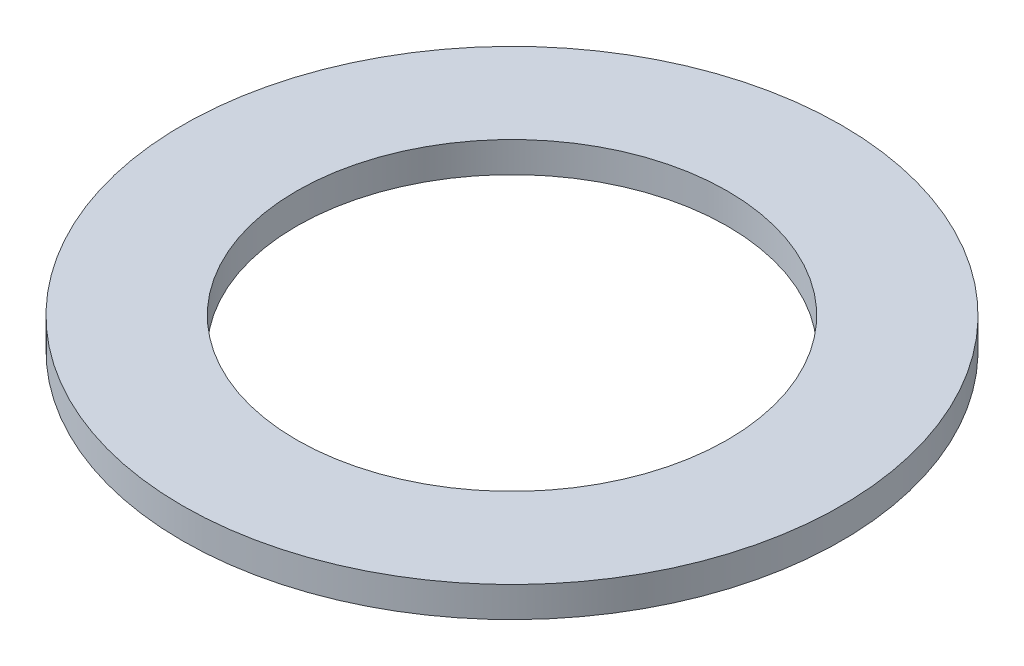
ISO-10303-21;
HEADER;
FILE_DESCRIPTION(('STEP AP214'),'2;1');
FILE_NAME('part.step','',(''),(''),'','','');
FILE_SCHEMA(('AUTOMOTIVE_DESIGN { 1 0 10303 214 1 1 1 1 }'));
ENDSEC;
DATA;
#1=APPLICATION_CONTEXT('core data for automotive mechanical design processes');
#2=APPLICATION_PROTOCOL_DEFINITION('international standard','automotive_design',2000,#1);
#3=PRODUCT_CONTEXT('',#1,'mechanical');
#4=PRODUCT('Part','Part','',(#3));
#5=PRODUCT_RELATED_PRODUCT_CATEGORY('part','',(#4));
#6=PRODUCT_DEFINITION_FORMATION('','',#4);
#7=PRODUCT_DEFINITION_CONTEXT('part definition',#1,'design');
#8=PRODUCT_DEFINITION('design','',#6,#7);
#9=PRODUCT_DEFINITION_SHAPE('','',#8);
#10=(LENGTH_UNIT() NAMED_UNIT(*) SI_UNIT(.MILLI.,.METRE.));
#11=(NAMED_UNIT(*) PLANE_ANGLE_UNIT() SI_UNIT($,.RADIAN.));
#12=(NAMED_UNIT(*) SI_UNIT($,.STERADIAN.) SOLID_ANGLE_UNIT());
#13=UNCERTAINTY_MEASURE_WITH_UNIT(LENGTH_MEASURE(1.E-05),#10,'distance_accuracy_value','');
#14=(GEOMETRIC_REPRESENTATION_CONTEXT(3) GLOBAL_UNCERTAINTY_ASSIGNED_CONTEXT((#13)) GLOBAL_UNIT_ASSIGNED_CONTEXT((#10,
#11,#12)) REPRESENTATION_CONTEXT('',''));
#15=CARTESIAN_POINT('',(0.,0.,0.));
#16=DIRECTION('',(0.,0.,1.));
#17=DIRECTION('',(1.,0.,0.));
#18=AXIS2_PLACEMENT_3D('',#15,#16,#17);
#19=CARTESIAN_POINT('',(0.,6.,0.));
#20=DIRECTION('',(0.,-1.,0.));
#21=DIRECTION('',(0.,0.,-1.));
#22=AXIS2_PLACEMENT_3D('',#19,#20,#21);
#23=CYLINDRICAL_SURFACE('',#22,65.);
#24=CARTESIAN_POINT('',(0.,6.,0.));
#25=DIRECTION('',(0.,1.,0.));
#26=DIRECTION('',(0.,0.,1.));
#27=AXIS2_PLACEMENT_3D('',#24,#25,#26);
#28=CIRCLE('',#27,65.);
#29=CARTESIAN_POINT('',(0.,6.,65.));
#30=VERTEX_POINT('',#29);
#31=EDGE_CURVE('E10',#30,#30,#28,.T.);
#32=ORIENTED_EDGE('',*,*,#31,.F.);
#33=EDGE_LOOP('',(#32));
#34=FACE_BOUND('',#33,.T.);
#35=CARTESIAN_POINT('',(0.,0.,0.));
#36=DIRECTION('',(0.,1.,0.));
#37=DIRECTION('',(0.,0.,1.));
#38=AXIS2_PLACEMENT_3D('',#35,#36,#37);
#39=CIRCLE('',#38,65.);
#40=CARTESIAN_POINT('',(0.,0.,65.));
#41=VERTEX_POINT('',#40);
#42=EDGE_CURVE('E37',#41,#41,#39,.T.);
#43=ORIENTED_EDGE('',*,*,#42,.T.);
#44=EDGE_LOOP('',(#43));
#45=FACE_BOUND('',#44,.T.);
#46=ADVANCED_FACE('F40',(#34,#45),#23,.T.);
#47=CARTESIAN_POINT('',(0.,6.,0.));
#48=DIRECTION('',(0.,1.,0.));
#49=DIRECTION('',(0.,0.,1.));
#50=AXIS2_PLACEMENT_3D('',#47,#48,#49);
#51=PLANE('',#50);
#52=CARTESIAN_POINT('',(0.,6.,0.));
#53=DIRECTION('',(0.,1.,0.));
#54=DIRECTION('',(0.,0.,1.));
#55=AXIS2_PLACEMENT_3D('',#52,#53,#54);
#56=CIRCLE('',#55,42.5);
#57=CARTESIAN_POINT('',(0.,6.,42.5));
#58=VERTEX_POINT('',#57);
#59=EDGE_CURVE('E50',#58,#58,#56,.T.);
#60=ORIENTED_EDGE('',*,*,#59,.F.);
#61=EDGE_LOOP('',(#60));
#62=FACE_BOUND('',#61,.T.);
#63=ORIENTED_EDGE('',*,*,#31,.T.);
#64=EDGE_LOOP('',(#63));
#65=FACE_BOUND('',#64,.T.);
#66=ADVANCED_FACE('F59',(#62,#65),#51,.T.);
#67=CARTESIAN_POINT('',(0.,0.,0.));
#68=DIRECTION('',(0.,1.,0.));
#69=DIRECTION('',(0.,0.,1.));
#70=AXIS2_PLACEMENT_3D('',#67,#68,#69);
#71=PLANE('',#70);
#72=CARTESIAN_POINT('',(0.,0.,0.));
#73=DIRECTION('',(0.,1.,0.));
#74=DIRECTION('',(0.,0.,1.));
#75=AXIS2_PLACEMENT_3D('',#72,#73,#74);
#76=CIRCLE('',#75,42.5);
#77=CARTESIAN_POINT('',(0.,0.,42.5));
#78=VERTEX_POINT('',#77);
#79=EDGE_CURVE('E47',#78,#78,#76,.T.);
#80=ORIENTED_EDGE('',*,*,#79,.T.);
#81=EDGE_LOOP('',(#80));
#82=FACE_BOUND('',#81,.T.);
#83=ORIENTED_EDGE('',*,*,#42,.F.);
#84=EDGE_LOOP('',(#83));
#85=FACE_BOUND('',#84,.T.);
#86=ADVANCED_FACE('F58',(#82,#85),#71,.F.);
#87=CARTESIAN_POINT('',(0.,6.,0.));
#88=DIRECTION('',(0.,-1.,0.));
#89=DIRECTION('',(0.,0.,-1.));
#90=AXIS2_PLACEMENT_3D('',#87,#88,#89);
#91=CYLINDRICAL_SURFACE('',#90,42.5);
#92=ORIENTED_EDGE('',*,*,#59,.T.);
#93=EDGE_LOOP('',(#92));
#94=FACE_BOUND('',#93,.T.);
#95=ORIENTED_EDGE('',*,*,#79,.F.);
#96=EDGE_LOOP('',(#95));
#97=FACE_BOUND('',#96,.T.);
#98=ADVANCED_FACE('F54',(#94,#97),#91,.F.);
#99=CLOSED_SHELL('',(#46,#66,#86,#98));
#100=MANIFOLD_SOLID_BREP('B2',#99);
#101=ADVANCED_BREP_SHAPE_REPRESENTATION('',(#18,#100),#14);
#102=SHAPE_DEFINITION_REPRESENTATION(#9,#101);
ENDSEC;
END-ISO-10303-21;
